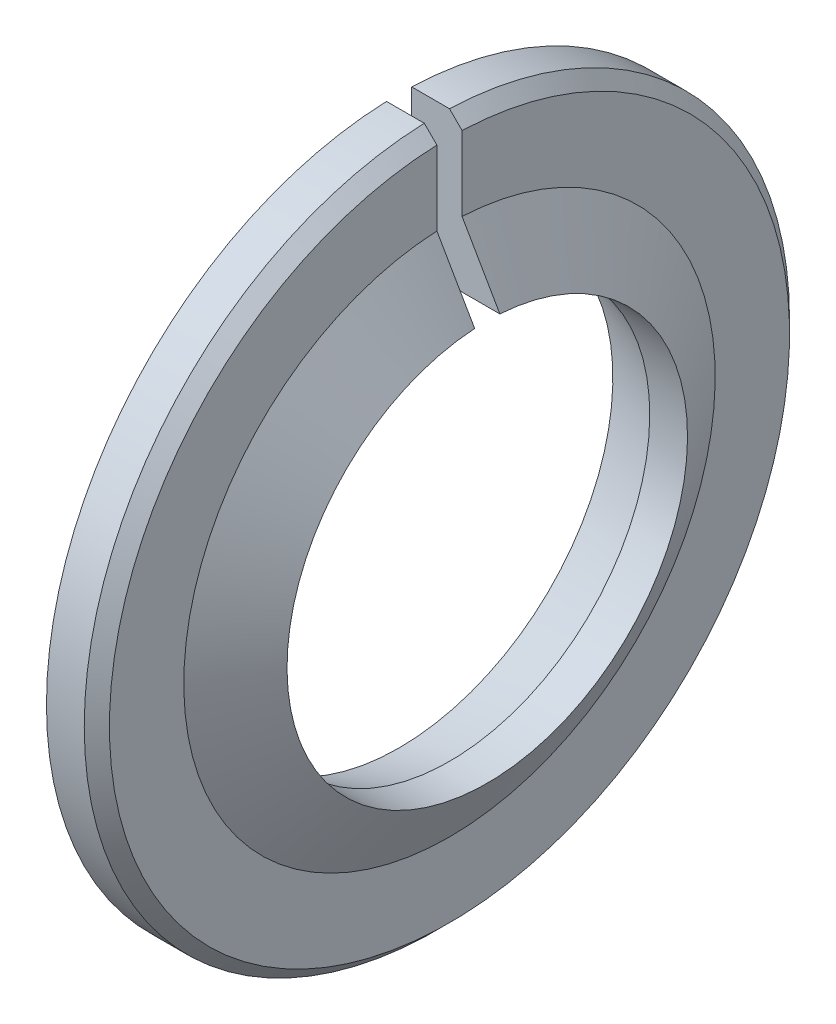
ISO-10303-21;
HEADER;
FILE_DESCRIPTION(('STEP AP214'),'2;1');
FILE_NAME('part.step','',(''),(''),'','','');
FILE_SCHEMA(('AUTOMOTIVE_DESIGN { 1 0 10303 214 1 1 1 1 }'));
ENDSEC;
DATA;
#1=APPLICATION_CONTEXT('core data for automotive mechanical design processes');
#2=APPLICATION_PROTOCOL_DEFINITION('international standard','automotive_design',2000,#1);
#3=PRODUCT_CONTEXT('',#1,'mechanical');
#4=PRODUCT('Part','Part','',(#3));
#5=PRODUCT_RELATED_PRODUCT_CATEGORY('part','',(#4));
#6=PRODUCT_DEFINITION_FORMATION('','',#4);
#7=PRODUCT_DEFINITION_CONTEXT('part definition',#1,'design');
#8=PRODUCT_DEFINITION('design','',#6,#7);
#9=PRODUCT_DEFINITION_SHAPE('','',#8);
#10=(LENGTH_UNIT() NAMED_UNIT(*) SI_UNIT(.MILLI.,.METRE.));
#11=(NAMED_UNIT(*) PLANE_ANGLE_UNIT() SI_UNIT($,.RADIAN.));
#12=(NAMED_UNIT(*) SI_UNIT($,.STERADIAN.) SOLID_ANGLE_UNIT());
#13=UNCERTAINTY_MEASURE_WITH_UNIT(LENGTH_MEASURE(1.E-05),#10,'distance_accuracy_value','');
#14=(GEOMETRIC_REPRESENTATION_CONTEXT(3) GLOBAL_UNCERTAINTY_ASSIGNED_CONTEXT((#13)) GLOBAL_UNIT_ASSIGNED_CONTEXT((#10,
#11,#12)) REPRESENTATION_CONTEXT('',''));
#15=CARTESIAN_POINT('',(0.,0.,0.));
#16=DIRECTION('',(0.,0.,1.));
#17=DIRECTION('',(1.,0.,0.));
#18=AXIS2_PLACEMENT_3D('',#15,#16,#17);
#19=CARTESIAN_POINT('',(-2.,0.,0.));
#20=DIRECTION('',(-1.,0.,0.));
#21=DIRECTION('',(0.,0.,1.));
#22=AXIS2_PLACEMENT_3D('',#19,#20,#21);
#23=CONICAL_SURFACE('',#22,8.48589838486223,0.261799387799143);
#24=CARTESIAN_POINT('',(-13.3357204832038,11.5124428321281,-0.5));
#25=CARTESIAN_POINT('',(-11.247253523238,10.9522978265261,-0.5));
#26=CARTESIAN_POINT('',(-9.15879903403004,10.3921062823094,-0.5));
#27=CARTESIAN_POINT('',(-4.98195388569182,9.27148575834977,-0.5));
#28=CARTESIAN_POINT('',(-2.89356322655805,8.71105677862014,-0.5));
#29=CARTESIAN_POINT('',(1.28311573252463,7.58981692893275,-0.5));
#30=CARTESIAN_POINT('',(3.37140403246732,7.02900605895183,-0.5));
#31=CARTESIAN_POINT('',(6.50368125119824,6.18721180055526,-0.5));
#32=CARTESIAN_POINT('',(7.54774781557188,5.90651738077954,-0.5));
#33=CARTESIAN_POINT('',(9.63579638023918,5.34481405920343,-0.5));
#34=CARTESIAN_POINT('',(10.6797783805297,5.06380515739157,-0.5));
#35=CARTESIAN_POINT('',(11.723701660467,4.78257810669005,-0.5));
#36=B_SPLINE_CURVE_WITH_KNOTS('',3,(#24,#25,#26,#27,#28,#29,#30,#31,#32,#33,#34,#35),
.UNSPECIFIED.,.F.,.F.,(4,2,2,2,2,4),(0.,6.48684131286622,12.9736822643263,19.4605236094498,
22.7039444683789,25.9473654457777),.UNSPECIFIED.);
#37=CARTESIAN_POINT('',(-2.,8.47115525759075,-0.5));
#38=VERTEX_POINT('',#37);
#39=CARTESIAN_POINT('',(0.,7.9342611502269,-0.5));
#40=VERTEX_POINT('',#39);
#41=EDGE_CURVE('E121',#38,#40,#36,.T.);
#42=ORIENTED_EDGE('',*,*,#41,.F.);
#43=CARTESIAN_POINT('',(-2.,0.,0.));
#44=DIRECTION('',(-1.,0.,0.));
#45=DIRECTION('',(0.,0.,1.));
#46=AXIS2_PLACEMENT_3D('',#43,#44,#45);
#47=CIRCLE('',#46,8.48589838486223);
#48=CARTESIAN_POINT('',(-2.,8.47115525759075,0.5));
#49=VERTEX_POINT('',#48);
#50=EDGE_CURVE('E115',#38,#49,#47,.T.);
#51=ORIENTED_EDGE('',*,*,#50,.T.);
#52=CARTESIAN_POINT('',(-13.3357204832038,11.5124428321281,0.5));
#53=CARTESIAN_POINT('',(-11.247253523238,10.9522978265261,0.5));
#54=CARTESIAN_POINT('',(-9.15879903403004,10.3921062823094,0.5));
#55=CARTESIAN_POINT('',(-4.98195388569182,9.27148575834977,0.5));
#56=CARTESIAN_POINT('',(-2.89356322655805,8.71105677862014,0.5));
#57=CARTESIAN_POINT('',(1.28311573252463,7.58981692893275,0.5));
#58=CARTESIAN_POINT('',(3.37140403246732,7.02900605895183,0.5));
#59=CARTESIAN_POINT('',(6.50368125119824,6.18721180055526,0.5));
#60=CARTESIAN_POINT('',(7.54774781557188,5.90651738077954,0.5));
#61=CARTESIAN_POINT('',(9.63579638023918,5.34481405920343,0.5));
#62=CARTESIAN_POINT('',(10.6797783805297,5.06380515739157,0.5));
#63=CARTESIAN_POINT('',(11.723701660467,4.78257810669005,0.5));
#64=B_SPLINE_CURVE_WITH_KNOTS('',3,(#52,#53,#54,#55,#56,#57,#58,#59,#60,#61,#62,#63),
.UNSPECIFIED.,.F.,.F.,(4,2,2,2,2,4),(0.,6.48684131286622,12.9736822643263,19.4605236094498,
22.7039444683789,25.9473654457777),.UNSPECIFIED.);
#65=CARTESIAN_POINT('',(0.,7.9342611502269,0.5));
#66=VERTEX_POINT('',#65);
#67=EDGE_CURVE('E98',#49,#66,#64,.T.);
#68=ORIENTED_EDGE('',*,*,#67,.T.);
#69=CARTESIAN_POINT('',(0.,0.,0.));
#70=DIRECTION('',(-1.,0.,0.));
#71=DIRECTION('',(0.,0.,1.));
#72=AXIS2_PLACEMENT_3D('',#69,#70,#71);
#73=CIRCLE('',#72,7.95);
#74=EDGE_CURVE('E138',#40,#66,#73,.T.);
#75=ORIENTED_EDGE('',*,*,#74,.F.);
#76=EDGE_LOOP('',(#42,#51,#68,#75));
#77=FACE_BOUND('',#76,.T.);
#78=ADVANCED_FACE('F36',(#77),#23,.F.);
#79=CARTESIAN_POINT('',(-6.17679811662559,0.,0.));
#80=DIRECTION('',(-1.,0.,0.));
#81=DIRECTION('',(0.,0.,1.));
#82=AXIS2_PLACEMENT_3D('',#79,#80,#81);
#83=CYLINDRICAL_SURFACE('',#82,7.95);
#84=DIRECTION('',(-1.,0.,0.));
#85=VECTOR('',#84,1.);
#86=CARTESIAN_POINT('',(-6.17679811662559,7.9342611502269,-0.5));
#87=LINE('',#86,#85);
#88=CARTESIAN_POINT('',(1.5,7.9342611502269,-0.5));
#89=VERTEX_POINT('',#88);
#90=EDGE_CURVE('E125',#40,#89,#87,.F.);
#91=ORIENTED_EDGE('',*,*,#90,.F.);
#92=ORIENTED_EDGE('',*,*,#74,.T.);
#93=DIRECTION('',(-1.,0.,0.));
#94=VECTOR('',#93,1.);
#95=CARTESIAN_POINT('',(-6.17679811662559,7.9342611502269,0.5));
#96=LINE('',#95,#94);
#97=CARTESIAN_POINT('',(1.5,7.9342611502269,0.5));
#98=VERTEX_POINT('',#97);
#99=EDGE_CURVE('E103',#66,#98,#96,.F.);
#100=ORIENTED_EDGE('',*,*,#99,.T.);
#101=CARTESIAN_POINT('',(1.5,0.,0.));
#102=DIRECTION('',(-1.,0.,0.));
#103=DIRECTION('',(0.,0.,1.));
#104=AXIS2_PLACEMENT_3D('',#101,#102,#103);
#105=CIRCLE('',#104,7.95);
#106=EDGE_CURVE('E135',#89,#98,#105,.T.);
#107=ORIENTED_EDGE('',*,*,#106,.F.);
#108=EDGE_LOOP('',(#91,#92,#100,#107));
#109=FACE_BOUND('',#108,.T.);
#110=ADVANCED_FACE('F175',(#109),#83,.F.);
#111=CARTESIAN_POINT('',(1.5,0.,0.));
#112=DIRECTION('',(-1.,0.,0.));
#113=DIRECTION('',(0.,0.,1.));
#114=AXIS2_PLACEMENT_3D('',#111,#112,#113);
#115=CONICAL_SURFACE('',#114,7.95,1.04719755119659);
#116=CARTESIAN_POINT('',(2.38782509363926,-6.39271814497121,-0.5));
#117=CARTESIAN_POINT('',(2.54334374366012,-6.12251450784551,-0.5));
#118=CARTESIAN_POINT('',(2.69882916249031,-5.85229168189097,-0.5));
#119=CARTESIAN_POINT('',(3.00966331636651,-5.31176462003764,-0.5));
#120=CARTESIAN_POINT('',(3.16501205033234,-5.04146038351776,-0.5));
#121=CARTESIAN_POINT('',(3.47567824252302,-4.50042158667612,-0.5));
#122=CARTESIAN_POINT('',(3.63099546048876,-4.22968688839139,-0.5));
#123=CARTESIAN_POINT('',(3.94127165548804,-3.68801436314191,-0.5));
#124=CARTESIAN_POINT('',(4.09623063482994,-3.41707653750101,-0.5));
#125=CARTESIAN_POINT('',(4.32758963823609,-3.01131390200916,-0.5));
#126=CARTESIAN_POINT('',(4.40425963302258,-2.87664306477934,-0.5));
#127=CARTESIAN_POINT('',(4.5573313100459,-2.60714635170991,-0.5));
#128=CARTESIAN_POINT('',(4.63373298855685,-2.47232047375162,-0.5));
#129=CARTESIAN_POINT('',(4.78605936861872,-2.20251362643857,-0.5));
#130=CARTESIAN_POINT('',(4.86198434479996,-2.06753281213724,-0.5));
#131=CARTESIAN_POINT('',(5.0131114422912,-1.79717190625146,-0.5));
#132=CARTESIAN_POINT('',(5.08831359082251,-1.66179182995591,-0.5));
#133=CARTESIAN_POINT('',(5.20029646472512,-1.45767189859273,-0.5));
#134=CARTESIAN_POINT('',(5.23761124066802,-1.38922537927284,-0.5));
#135=CARTESIAN_POINT('',(5.3116938316991,-1.25202790436129,-0.5));
#136=CARTESIAN_POINT('',(5.34846159782726,-1.18327692222492,-0.5));
#137=CARTESIAN_POINT('',(5.42119195988337,-1.04520353731802,-0.5));
#138=CARTESIAN_POINT('',(5.45715311302139,-0.975880373631923,-0.5));
#139=CARTESIAN_POINT('',(5.52762358783402,-0.836504467697241,-0.5));
#140=CARTESIAN_POINT('',(5.56213318775588,-0.766451868515186,-0.5));
#141=CARTESIAN_POINT('',(5.61241284413694,-0.659185699862089,-0.5));
#142=CARTESIAN_POINT('',(5.62918679320184,-0.622445258291185,-0.5));
#143=CARTESIAN_POINT('',(5.66165777810571,-0.548492313888752,-0.5));
#144=CARTESIAN_POINT('',(5.67735495748382,-0.511279874763738,-0.5));
#145=CARTESIAN_POINT('',(5.70714485880235,-0.436263132408765,-0.5));
#146=CARTESIAN_POINT('',(5.72123952126519,-0.398459609451356,-0.5));
#147=CARTESIAN_POINT('',(5.74703291254339,-0.322033427946696,-0.5));
#148=CARTESIAN_POINT('',(5.75873268576771,-0.283411134608745,-0.5));
#149=CARTESIAN_POINT('',(5.77555768070906,-0.217019711390778,-0.5));
#150=CARTESIAN_POINT('',(5.78160166266328,-0.189487423087857,-0.5));
#151=CARTESIAN_POINT('',(5.79145514266921,-0.134030954542856,-0.5));
#152=CARTESIAN_POINT('',(5.79526602893331,-0.106107028843645,-0.5));
#153=CARTESIAN_POINT('',(5.80024487928605,-0.0501753076858447,-0.5));
#154=CARTESIAN_POINT('',(5.80142768420916,-0.0221688821020261,-0.5));
#155=CARTESIAN_POINT('',(5.80105210346876,0.0338255573995088,-0.5));
#156=CARTESIAN_POINT('',(5.79949352439554,0.061813569878781,-0.5));
#157=CARTESIAN_POINT('',(5.79288539265126,0.126639567715719,-0.5));
#158=CARTESIAN_POINT('',(5.7868604051453,0.163376682436974,-0.5));
#159=CARTESIAN_POINT('',(5.77129595983192,0.236099059362619,-0.5));
#160=CARTESIAN_POINT('',(5.761752651668,0.272083452044069,-0.5));
#161=CARTESIAN_POINT('',(5.74006979897855,0.343743362139789,-0.5));
#162=CARTESIAN_POINT('',(5.72789860451017,0.379409039839946,-0.5));
#163=CARTESIAN_POINT('',(5.7018473108163,0.450081882560193,-0.5));
#164=CARTESIAN_POINT('',(5.68796791151003,0.485089310558083,-0.5));
#165=CARTESIAN_POINT('',(5.65723005019308,0.558959497698336,-0.5));
#166=CARTESIAN_POINT('',(5.64021609944225,0.597756898339796,-0.5));
#167=CARTESIAN_POINT('',(5.60519104679065,0.674901122437465,-0.5));
#168=CARTESIAN_POINT('',(5.58717980308285,0.713247880871385,-0.5));
#169=CARTESIAN_POINT('',(5.53211410829064,0.827834301147929,-0.5));
#170=CARTESIAN_POINT('',(5.49404375307737,0.903583411628954,-0.5));
#171=CARTESIAN_POINT('',(5.41645095804202,1.05446033192295,-0.5));
#172=CARTESIAN_POINT('',(5.37692651180106,1.12958709351484,-0.5));
#173=CARTESIAN_POINT('',(5.29705496146375,1.2793741476586,-0.5));
#174=CARTESIAN_POINT('',(5.25670809532063,1.35403456719501,-0.5));
#175=CARTESIAN_POINT('',(5.17570673191133,1.5026752987243,-0.5));
#176=CARTESIAN_POINT('',(5.13505499204102,1.57665711903832,-0.5));
#177=CARTESIAN_POINT('',(5.05339956658011,1.72443327331866,-0.5));
#178=CARTESIAN_POINT('',(5.01239585515847,1.79822759300032,-0.5));
#179=CARTESIAN_POINT('',(4.88909909859935,2.01927792570268,-0.5));
#180=CARTESIAN_POINT('',(4.80644764134551,2.1663338283873,-0.5));
#181=CARTESIAN_POINT('',(4.64085405367501,2.45976355007156,-0.5));
#182=CARTESIAN_POINT('',(4.55791328906996,2.60613814181724,-0.5));
#183=CARTESIAN_POINT('',(4.39171677411182,2.89870846783963,-0.5));
#184=CARTESIAN_POINT('',(4.30846102357132,3.04490420200987,-0.5));
#185=CARTESIAN_POINT('',(4.05839389583257,3.48332520962513,-0.5));
#186=CARTESIAN_POINT('',(3.89128476308129,3.77538054679001,-0.5));
#187=CARTESIAN_POINT('',(3.55662990890447,4.35937102946583,-0.5));
#188=CARTESIAN_POINT('',(3.38908405970527,4.65130610167335,-0.5));
#189=CARTESIAN_POINT('',(3.05377128418214,5.23504745833441,-0.5));
#190=CARTESIAN_POINT('',(2.88600435888254,5.52685374337638,-0.5));
#191=CARTESIAN_POINT('',(2.38203124510145,6.40298296413579,-0.5));
#192=CARTESIAN_POINT('',(2.04562617102011,6.98719146670213,-0.5));
#193=CARTESIAN_POINT('',(1.37261187477959,8.15541549761393,-0.5));
#194=CARTESIAN_POINT('',(1.03600267553439,8.73943103916518,-0.5));
#195=CARTESIAN_POINT('',(0.333014518975229,9.95879287481724,-0.5));
#196=CARTESIAN_POINT('',(-0.0333766116288165,10.5941321507673,-0.5));
#197=CARTESIAN_POINT('',(-0.766260383643103,11.8647803219578,-0.5));
#198=CARTESIAN_POINT('',(-1.13275302802555,12.5000892154837,-0.5));
#199=CARTESIAN_POINT('',(-1.86520570049543,13.7696536299233,-0.5));
#200=CARTESIAN_POINT('',(-2.23116563810356,14.4039092030379,-0.5));
#201=CARTESIAN_POINT('',(-2.96311230968334,15.6723767327685,-0.5));
#202=CARTESIAN_POINT('',(-3.32909904235677,16.3065886901335,-0.5));
#203=CARTESIAN_POINT('',(-3.69509667352344,16.9407943563245,-0.5));
#204=B_SPLINE_CURVE_WITH_KNOTS('',3,(#116,#117,#118,#119,#120,#121,#122,#123,#124,#125,#126,
#127,#128,#129,#130,#131,#132,#133,#134,#135,#136,#137,#138,#139,#140,#141,#142,#143,#144,#145,
#146,#147,#148,#149,#150,#151,#152,#153,#154,#155,#156,#157,#158,#159,#160,#161,#162,#163,#164,
#165,#166,#167,#168,#169,#170,#171,#172,#173,#174,#175,#176,#177,#178,#179,#180,#181,#182,#183,
#184,#185,#186,#187,#188,#189,#190,#191,#192,#193,#194,#195,#196,#197,#198,#199,#200,#201,#202,
#203),.UNSPECIFIED.,.F.,.F.,(4,2,2,2,2,2,2,2,2,2,2,2,2,2,2,2,2,2,2,2,2,2,2,2,2,2,2,2,2,2,2,2,2,
2,2,2,2,2,2,2,2,2,2,4),(0.,0.93528854780098,1.87058442159663,2.80695309819669,3.74331572425407,
4.20821416398925,4.67311903405399,5.13772555649972,5.60231451301351,5.83618463562092,
6.0700755663053,6.30435598918441,6.53859129641646,6.65974559141836,6.7808837043921,
6.90187353010763,7.02281047933006,7.10730228524976,7.19174151064234,7.27570268078445,
7.35966977478006,7.47111258398203,7.58267771702404,7.69567001539367,7.80861616951842,
7.93568713722248,8.06277622002974,8.31707447015489,8.57173784145319,8.82632854770442,
9.07957213760189,9.33283447459768,9.83890558538647,10.343625140478,10.8483449959094,
11.857797608371,12.8675892282811,13.8773761858301,15.8998031768603,17.9220343952109,
20.1222812066395,22.3226012344745,24.5193855351145,26.71609667849),.UNSPECIFIED.);
#205=CARTESIAN_POINT('',(0.,10.5362190448242,-0.5));
#206=VERTEX_POINT('',#205);
#207=EDGE_CURVE('E180',#89,#206,#204,.T.);
#208=ORIENTED_EDGE('',*,*,#207,.F.);
#209=ORIENTED_EDGE('',*,*,#106,.T.);
#210=CARTESIAN_POINT('',(2.38782509363926,-6.39271814497121,0.5));
#211=CARTESIAN_POINT('',(2.54334374366012,-6.12251450784551,0.5));
#212=CARTESIAN_POINT('',(2.69882916249031,-5.85229168189097,0.5));
#213=CARTESIAN_POINT('',(3.00966331636651,-5.31176462003764,0.5));
#214=CARTESIAN_POINT('',(3.16501205033234,-5.04146038351776,0.5));
#215=CARTESIAN_POINT('',(3.47567824252302,-4.50042158667612,0.5));
#216=CARTESIAN_POINT('',(3.63099546048876,-4.22968688839139,0.5));
#217=CARTESIAN_POINT('',(3.94127165548804,-3.68801436314191,0.5));
#218=CARTESIAN_POINT('',(4.09623063482994,-3.41707653750101,0.5));
#219=CARTESIAN_POINT('',(4.32758963823609,-3.01131390200916,0.5));
#220=CARTESIAN_POINT('',(4.40425963302258,-2.87664306477934,0.5));
#221=CARTESIAN_POINT('',(4.5573313100459,-2.60714635170991,0.5));
#222=CARTESIAN_POINT('',(4.63373298855685,-2.47232047375162,0.5));
#223=CARTESIAN_POINT('',(4.78605936861872,-2.20251362643857,0.5));
#224=CARTESIAN_POINT('',(4.86198434479996,-2.06753281213724,0.5));
#225=CARTESIAN_POINT('',(5.0131114422912,-1.79717190625146,0.5));
#226=CARTESIAN_POINT('',(5.08831359082251,-1.66179182995591,0.5));
#227=CARTESIAN_POINT('',(5.20029646472512,-1.45767189859273,0.5));
#228=CARTESIAN_POINT('',(5.23761124066802,-1.38922537927284,0.5));
#229=CARTESIAN_POINT('',(5.3116938316991,-1.25202790436129,0.5));
#230=CARTESIAN_POINT('',(5.34846159782726,-1.18327692222492,0.5));
#231=CARTESIAN_POINT('',(5.42119195988337,-1.04520353731802,0.5));
#232=CARTESIAN_POINT('',(5.45715311302139,-0.975880373631923,0.5));
#233=CARTESIAN_POINT('',(5.52762358783402,-0.836504467697241,0.5));
#234=CARTESIAN_POINT('',(5.56213318775588,-0.766451868515186,0.5));
#235=CARTESIAN_POINT('',(5.61241284413694,-0.659185699862089,0.5));
#236=CARTESIAN_POINT('',(5.62918679320184,-0.622445258291185,0.5));
#237=CARTESIAN_POINT('',(5.66165777810571,-0.548492313888752,0.5));
#238=CARTESIAN_POINT('',(5.67735495748382,-0.511279874763738,0.5));
#239=CARTESIAN_POINT('',(5.70714485880235,-0.436263132408765,0.5));
#240=CARTESIAN_POINT('',(5.72123952126519,-0.398459609451356,0.5));
#241=CARTESIAN_POINT('',(5.74703291254339,-0.322033427946696,0.5));
#242=CARTESIAN_POINT('',(5.75873268576771,-0.283411134608745,0.5));
#243=CARTESIAN_POINT('',(5.77555768070906,-0.217019711390778,0.5));
#244=CARTESIAN_POINT('',(5.78160166266328,-0.189487423087857,0.5));
#245=CARTESIAN_POINT('',(5.79145514266921,-0.134030954542856,0.5));
#246=CARTESIAN_POINT('',(5.79526602893331,-0.106107028843645,0.5));
#247=CARTESIAN_POINT('',(5.80024487928605,-0.0501753076858447,0.5));
#248=CARTESIAN_POINT('',(5.80142768420916,-0.0221688821020261,0.5));
#249=CARTESIAN_POINT('',(5.80105210346876,0.0338255573995088,0.5));
#250=CARTESIAN_POINT('',(5.79949352439554,0.061813569878781,0.5));
#251=CARTESIAN_POINT('',(5.79288539265126,0.126639567715719,0.5));
#252=CARTESIAN_POINT('',(5.7868604051453,0.163376682436974,0.5));
#253=CARTESIAN_POINT('',(5.77129595983192,0.236099059362619,0.5));
#254=CARTESIAN_POINT('',(5.761752651668,0.272083452044069,0.5));
#255=CARTESIAN_POINT('',(5.74006979897855,0.343743362139789,0.5));
#256=CARTESIAN_POINT('',(5.72789860451017,0.379409039839946,0.5));
#257=CARTESIAN_POINT('',(5.7018473108163,0.450081882560193,0.5));
#258=CARTESIAN_POINT('',(5.68796791151003,0.485089310558083,0.5));
#259=CARTESIAN_POINT('',(5.65723005019308,0.558959497698336,0.5));
#260=CARTESIAN_POINT('',(5.64021609944225,0.597756898339796,0.5));
#261=CARTESIAN_POINT('',(5.60519104679065,0.674901122437465,0.5));
#262=CARTESIAN_POINT('',(5.58717980308285,0.713247880871385,0.5));
#263=CARTESIAN_POINT('',(5.53211410829064,0.827834301147929,0.5));
#264=CARTESIAN_POINT('',(5.49404375307737,0.903583411628954,0.5));
#265=CARTESIAN_POINT('',(5.41645095804202,1.05446033192295,0.5));
#266=CARTESIAN_POINT('',(5.37692651180106,1.12958709351484,0.5));
#267=CARTESIAN_POINT('',(5.29705496146375,1.2793741476586,0.5));
#268=CARTESIAN_POINT('',(5.25670809532063,1.35403456719501,0.5));
#269=CARTESIAN_POINT('',(5.17570673191133,1.5026752987243,0.5));
#270=CARTESIAN_POINT('',(5.13505499204102,1.57665711903832,0.5));
#271=CARTESIAN_POINT('',(5.05339956658011,1.72443327331866,0.5));
#272=CARTESIAN_POINT('',(5.01239585515847,1.79822759300032,0.5));
#273=CARTESIAN_POINT('',(4.88909909859935,2.01927792570268,0.5));
#274=CARTESIAN_POINT('',(4.80644764134551,2.1663338283873,0.5));
#275=CARTESIAN_POINT('',(4.64085405367501,2.45976355007156,0.5));
#276=CARTESIAN_POINT('',(4.55791328906996,2.60613814181724,0.5));
#277=CARTESIAN_POINT('',(4.39171677411182,2.89870846783963,0.5));
#278=CARTESIAN_POINT('',(4.30846102357132,3.04490420200987,0.5));
#279=CARTESIAN_POINT('',(4.05839389583257,3.48332520962513,0.5));
#280=CARTESIAN_POINT('',(3.89128476308129,3.77538054679001,0.5));
#281=CARTESIAN_POINT('',(3.55662990890447,4.35937102946583,0.5));
#282=CARTESIAN_POINT('',(3.38908405970527,4.65130610167335,0.5));
#283=CARTESIAN_POINT('',(3.05377128418214,5.23504745833441,0.5));
#284=CARTESIAN_POINT('',(2.88600435888254,5.52685374337638,0.5));
#285=CARTESIAN_POINT('',(2.38203124510145,6.40298296413579,0.5));
#286=CARTESIAN_POINT('',(2.04562617102011,6.98719146670213,0.5));
#287=CARTESIAN_POINT('',(1.37261187477959,8.15541549761393,0.5));
#288=CARTESIAN_POINT('',(1.03600267553439,8.73943103916518,0.5));
#289=CARTESIAN_POINT('',(0.333014518975229,9.95879287481724,0.5));
#290=CARTESIAN_POINT('',(-0.0333766116288165,10.5941321507673,0.5));
#291=CARTESIAN_POINT('',(-0.766260383643103,11.8647803219578,0.5));
#292=CARTESIAN_POINT('',(-1.13275302802555,12.5000892154837,0.5));
#293=CARTESIAN_POINT('',(-1.86520570049543,13.7696536299233,0.5));
#294=CARTESIAN_POINT('',(-2.23116563810356,14.4039092030379,0.5));
#295=CARTESIAN_POINT('',(-2.96311230968334,15.6723767327685,0.5));
#296=CARTESIAN_POINT('',(-3.32909904235677,16.3065886901335,0.5));
#297=CARTESIAN_POINT('',(-3.69509667352344,16.9407943563245,0.5));
#298=B_SPLINE_CURVE_WITH_KNOTS('',3,(#210,#211,#212,#213,#214,#215,#216,#217,#218,#219,#220,
#221,#222,#223,#224,#225,#226,#227,#228,#229,#230,#231,#232,#233,#234,#235,#236,#237,#238,#239,
#240,#241,#242,#243,#244,#245,#246,#247,#248,#249,#250,#251,#252,#253,#254,#255,#256,#257,#258,
#259,#260,#261,#262,#263,#264,#265,#266,#267,#268,#269,#270,#271,#272,#273,#274,#275,#276,#277,
#278,#279,#280,#281,#282,#283,#284,#285,#286,#287,#288,#289,#290,#291,#292,#293,#294,#295,#296,
#297),.UNSPECIFIED.,.F.,.F.,(4,2,2,2,2,2,2,2,2,2,2,2,2,2,2,2,2,2,2,2,2,2,2,2,2,2,2,2,2,2,2,2,2,
2,2,2,2,2,2,2,2,2,2,4),(0.,0.93528854780098,1.87058442159663,2.80695309819669,3.74331572425407,
4.20821416398925,4.67311903405399,5.13772555649972,5.60231451301351,5.83618463562092,
6.0700755663053,6.30435598918441,6.53859129641646,6.65974559141836,6.7808837043921,
6.90187353010763,7.02281047933006,7.10730228524976,7.19174151064234,7.27570268078445,
7.35966977478006,7.47111258398203,7.58267771702404,7.69567001539367,7.80861616951842,
7.93568713722248,8.06277622002974,8.31707447015489,8.57173784145319,8.82632854770442,
9.07957213760189,9.33283447459768,9.83890558538647,10.343625140478,10.8483449959094,
11.857797608371,12.8675892282811,13.8773761858301,15.8998031768603,17.9220343952109,
20.1222812066395,22.3226012344745,24.5193855351145,26.71609667849),.UNSPECIFIED.);
#299=CARTESIAN_POINT('',(0.,10.5362190448242,0.5));
#300=VERTEX_POINT('',#299);
#301=EDGE_CURVE('E158',#98,#300,#298,.T.);
#302=ORIENTED_EDGE('',*,*,#301,.T.);
#303=CARTESIAN_POINT('',(0.,0.,0.));
#304=DIRECTION('',(-1.,0.,0.));
#305=DIRECTION('',(0.,0.,1.));
#306=AXIS2_PLACEMENT_3D('',#303,#304,#305);
#307=CIRCLE('',#306,10.5480762113533);
#308=EDGE_CURVE('E123',#206,#300,#307,.T.);
#309=ORIENTED_EDGE('',*,*,#308,.F.);
#310=EDGE_LOOP('',(#208,#209,#302,#309));
#311=FACE_BOUND('',#310,.T.);
#312=ADVANCED_FACE('F169',(#311),#115,.T.);
#313=CARTESIAN_POINT('',(0.,14.,0.));
#314=DIRECTION('',(-1.,0.,0.));
#315=DIRECTION('',(0.,0.,1.));
#316=AXIS2_PLACEMENT_3D('',#313,#314,#315);
#317=PLANE('',#316);
#318=DIRECTION('',(0.,1.,0.));
#319=VECTOR('',#318,1.);
#320=CARTESIAN_POINT('',(0.,14.,-0.5));
#321=LINE('',#320,#319);
#322=CARTESIAN_POINT('',(0.,13.490737563232,-0.5));
#323=VERTEX_POINT('',#322);
#324=EDGE_CURVE('E65',#206,#323,#321,.T.);
#325=ORIENTED_EDGE('',*,*,#324,.F.);
#326=ORIENTED_EDGE('',*,*,#308,.T.);
#327=DIRECTION('',(0.,1.,0.));
#328=VECTOR('',#327,1.);
#329=CARTESIAN_POINT('',(0.,14.,0.5));
#330=LINE('',#329,#328);
#331=CARTESIAN_POINT('',(0.,13.490737563232,0.5));
#332=VERTEX_POINT('',#331);
#333=EDGE_CURVE('E167',#300,#332,#330,.T.);
#334=ORIENTED_EDGE('',*,*,#333,.T.);
#335=CARTESIAN_POINT('',(0.,0.,0.));
#336=DIRECTION('',(-1.,0.,0.));
#337=DIRECTION('',(0.,0.,1.));
#338=AXIS2_PLACEMENT_3D('',#335,#336,#337);
#339=CIRCLE('',#338,13.5);
#340=EDGE_CURVE('E143',#332,#323,#339,.F.);
#341=ORIENTED_EDGE('',*,*,#340,.T.);
#342=EDGE_LOOP('',(#325,#326,#334,#341));
#343=FACE_BOUND('',#342,.T.);
#344=ADVANCED_FACE('F174',(#343),#317,.F.);
#345=CARTESIAN_POINT('',(-6.17679811662559,0.,0.));
#346=DIRECTION('',(-1.,0.,0.));
#347=DIRECTION('',(0.,0.,1.));
#348=AXIS2_PLACEMENT_3D('',#345,#346,#347);
#349=CYLINDRICAL_SURFACE('',#348,14.);
#350=DIRECTION('',(-1.,0.,0.));
#351=VECTOR('',#350,1.);
#352=CARTESIAN_POINT('',(-6.17679811662559,13.9910685796332,-0.5));
#353=LINE('',#352,#351);
#354=CARTESIAN_POINT('',(-0.500000000000009,13.9910685796332,-0.5));
#355=VERTEX_POINT('',#354);
#356=CARTESIAN_POINT('',(-2.,13.9910685796332,-0.5));
#357=VERTEX_POINT('',#356);
#358=EDGE_CURVE('E108',#355,#357,#353,.T.);
#359=ORIENTED_EDGE('',*,*,#358,.F.);
#360=CARTESIAN_POINT('',(-0.500000000000009,0.,0.));
#361=DIRECTION('',(-1.,0.,0.));
#362=DIRECTION('',(0.,0.,1.));
#363=AXIS2_PLACEMENT_3D('',#360,#361,#362);
#364=CIRCLE('',#363,14.);
#365=CARTESIAN_POINT('',(-0.500000000000009,13.9910685796332,0.5));
#366=VERTEX_POINT('',#365);
#367=EDGE_CURVE('E140',#355,#366,#364,.T.);
#368=ORIENTED_EDGE('',*,*,#367,.T.);
#369=DIRECTION('',(-1.,0.,0.));
#370=VECTOR('',#369,1.);
#371=CARTESIAN_POINT('',(-6.17679811662559,13.9910685796332,0.5));
#372=LINE('',#371,#370);
#373=CARTESIAN_POINT('',(-2.,13.9910685796332,0.5));
#374=VERTEX_POINT('',#373);
#375=EDGE_CURVE('E57',#366,#374,#372,.T.);
#376=ORIENTED_EDGE('',*,*,#375,.T.);
#377=CARTESIAN_POINT('',(-2.,0.,0.));
#378=DIRECTION('',(-1.,0.,0.));
#379=DIRECTION('',(0.,0.,1.));
#380=AXIS2_PLACEMENT_3D('',#377,#378,#379);
#381=CIRCLE('',#380,14.);
#382=EDGE_CURVE('E117',#357,#374,#381,.T.);
#383=ORIENTED_EDGE('',*,*,#382,.F.);
#384=EDGE_LOOP('',(#359,#368,#376,#383));
#385=FACE_BOUND('',#384,.T.);
#386=ADVANCED_FACE('F208',(#385),#349,.T.);
#387=CARTESIAN_POINT('',(-2.,14.,0.));
#388=DIRECTION('',(1.,0.,0.));
#389=DIRECTION('',(0.,0.,-1.));
#390=AXIS2_PLACEMENT_3D('',#387,#388,#389);
#391=PLANE('',#390);
#392=DIRECTION('',(0.,1.,0.));
#393=VECTOR('',#392,1.);
#394=CARTESIAN_POINT('',(-2.,0.,-0.5));
#395=LINE('',#394,#393);
#396=EDGE_CURVE('E118',#38,#357,#395,.T.);
#397=ORIENTED_EDGE('',*,*,#396,.T.);
#398=ORIENTED_EDGE('',*,*,#382,.T.);
#399=DIRECTION('',(0.,1.,0.));
#400=VECTOR('',#399,1.);
#401=CARTESIAN_POINT('',(-2.,0.,0.5));
#402=LINE('',#401,#400);
#403=EDGE_CURVE('E101',#49,#374,#402,.T.);
#404=ORIENTED_EDGE('',*,*,#403,.F.);
#405=ORIENTED_EDGE('',*,*,#50,.F.);
#406=EDGE_LOOP('',(#397,#398,#404,#405));
#407=FACE_BOUND('',#406,.T.);
#408=ADVANCED_FACE('F114',(#407),#391,.F.);
#409=CARTESIAN_POINT('',(-0.500000000000009,0.,0.));
#410=DIRECTION('',(-1.,0.,0.));
#411=DIRECTION('',(0.,0.,1.));
#412=AXIS2_PLACEMENT_3D('',#409,#410,#411);
#413=CONICAL_SURFACE('',#412,14.,0.78539816339745);
#414=ORIENTED_EDGE('',*,*,#367,.F.);
#415=CARTESIAN_POINT('',(-10.2755979888361,23.770339916096,-0.5));
#416=CARTESIAN_POINT('',(-9.37792460354182,22.8724656213733,-0.5));
#417=CARTESIAN_POINT('',(-8.48026029007237,21.9745822556273,-0.5));
#418=CARTESIAN_POINT('',(-6.68496478479847,20.1787830384338,-0.5));
#419=CARTESIAN_POINT('',(-5.78733359298259,19.2808671869977,-0.5));
#420=CARTESIAN_POINT('',(-3.99211955032411,17.4849888962837,-0.5));
#421=CARTESIAN_POINT('',(-3.09453669943563,16.5870264570517,-0.5));
#422=CARTESIAN_POINT('',(-1.29944621026801,14.7910257918512,-0.5));
#423=CARTESIAN_POINT('',(-0.401938572014484,13.892987565857,-0.5));
#424=CARTESIAN_POINT('',(0.944223224539855,12.5458288571919,-0.5));
#425=CARTESIAN_POINT('',(1.3929276584399,12.0967586137089,-0.5));
#426=CARTESIAN_POINT('',(2.29028915722917,11.1985709195923,-0.5));
#427=CARTESIAN_POINT('',(2.73894622212467,10.749453468965,-0.5));
#428=CARTESIAN_POINT('',(3.63619211878456,9.85115133912281,-0.5));
#429=CARTESIAN_POINT('',(4.08478095061905,9.40196665997799,-0.5));
#430=CARTESIAN_POINT('',(4.98185563441127,8.5034940538214,-0.5));
#431=CARTESIAN_POINT('',(5.43034148632001,8.05420612676071,-0.5));
#432=CARTESIAN_POINT('',(6.3271499056191,7.15546410855183,-0.5));
#433=CARTESIAN_POINT('',(6.77547247242213,6.70601001681743,-0.5));
#434=CARTESIAN_POINT('',(7.44773160034041,6.03160557793816,-0.5));
#435=CARTESIAN_POINT('',(7.67178034204398,5.80676706280433,-0.5));
#436=CARTESIAN_POINT('',(8.11977092918339,5.35698333325587,-0.5));
#437=CARTESIAN_POINT('',(8.34371277456665,5.13203811878888,-0.5));
#438=CARTESIAN_POINT('',(8.79144185575788,4.68199133743542,-0.5));
#439=CARTESIAN_POINT('',(9.01522909069584,4.4568897696832,-0.5));
#440=CARTESIAN_POINT('',(9.46256111562282,4.0064464382064,-0.5));
#441=CARTESIAN_POINT('',(9.68610590594215,3.78110467480988,-0.5));
#442=CARTESIAN_POINT('',(10.1327974106834,3.33002389780191,-0.5));
#443=CARTESIAN_POINT('',(10.3559441227364,3.10428488184221,-0.5));
#444=CARTESIAN_POINT('',(10.6901026308629,2.76512167032844,-0.5));
#445=CARTESIAN_POINT('',(10.8013954664476,2.65197455338685,-0.5));
#446=CARTESIAN_POINT('',(11.0236932992255,2.42539743251905,-0.5));
#447=CARTESIAN_POINT('',(11.1346982956824,2.31196742787051,-0.5));
#448=CARTESIAN_POINT('',(11.2455088495292,2.19834718539887,-0.5));
#449=B_SPLINE_CURVE_WITH_KNOTS('',3,(#415,#416,#417,#418,#419,#420,#421,#422,#423,#424,#425,
#426,#427,#428,#429,#430,#431,#432,#433,#434,#435,#436,#437,#438,#439,#440,#441,#442,#443,#444,
#445,#446,#447,#448),.UNSPECIFIED.,.F.,.F.,(4,2,2,2,2,2,2,2,2,2,2,2,2,2,2,2,4),(0.,
3.80893184662486,7.61786236406776,11.4267891989569,15.2357173252545,17.1401851678976,
19.0446527577589,20.9491183775865,22.853584901676,24.7580582097251,25.7102933282199,
26.6625289145415,27.6147698161593,28.5670094188027,29.5192546693834,29.9953795209401,
30.471505589492),.UNSPECIFIED.);
#450=EDGE_CURVE('E11',#355,#323,#449,.T.);
#451=ORIENTED_EDGE('',*,*,#450,.T.);
#452=ORIENTED_EDGE('',*,*,#340,.F.);
#453=CARTESIAN_POINT('',(-10.2755979888361,23.770339916096,0.5));
#454=CARTESIAN_POINT('',(-9.37792460354182,22.8724656213733,0.5));
#455=CARTESIAN_POINT('',(-8.48026029007237,21.9745822556273,0.5));
#456=CARTESIAN_POINT('',(-6.68496478479847,20.1787830384338,0.5));
#457=CARTESIAN_POINT('',(-5.78733359298259,19.2808671869977,0.5));
#458=CARTESIAN_POINT('',(-3.99211955032411,17.4849888962837,0.5));
#459=CARTESIAN_POINT('',(-3.09453669943563,16.5870264570517,0.5));
#460=CARTESIAN_POINT('',(-1.29944621026801,14.7910257918512,0.5));
#461=CARTESIAN_POINT('',(-0.401938572014484,13.892987565857,0.5));
#462=CARTESIAN_POINT('',(0.944223224539855,12.5458288571919,0.5));
#463=CARTESIAN_POINT('',(1.3929276584399,12.0967586137089,0.5));
#464=CARTESIAN_POINT('',(2.29028915722917,11.1985709195923,0.5));
#465=CARTESIAN_POINT('',(2.73894622212467,10.749453468965,0.5));
#466=CARTESIAN_POINT('',(3.63619211878456,9.85115133912281,0.5));
#467=CARTESIAN_POINT('',(4.08478095061905,9.40196665997799,0.5));
#468=CARTESIAN_POINT('',(4.98185563441127,8.5034940538214,0.5));
#469=CARTESIAN_POINT('',(5.43034148632001,8.05420612676071,0.5));
#470=CARTESIAN_POINT('',(6.3271499056191,7.15546410855183,0.5));
#471=CARTESIAN_POINT('',(6.77547247242213,6.70601001681743,0.5));
#472=CARTESIAN_POINT('',(7.44773160034041,6.03160557793816,0.5));
#473=CARTESIAN_POINT('',(7.67178034204398,5.80676706280433,0.5));
#474=CARTESIAN_POINT('',(8.11977092918339,5.35698333325587,0.5));
#475=CARTESIAN_POINT('',(8.34371277456665,5.13203811878888,0.5));
#476=CARTESIAN_POINT('',(8.79144185575788,4.68199133743542,0.5));
#477=CARTESIAN_POINT('',(9.01522909069584,4.4568897696832,0.5));
#478=CARTESIAN_POINT('',(9.46256111562282,4.0064464382064,0.5));
#479=CARTESIAN_POINT('',(9.68610590594215,3.78110467480988,0.5));
#480=CARTESIAN_POINT('',(10.1327974106834,3.33002389780191,0.5));
#481=CARTESIAN_POINT('',(10.3559441227364,3.10428488184221,0.5));
#482=CARTESIAN_POINT('',(10.6901026308629,2.76512167032844,0.5));
#483=CARTESIAN_POINT('',(10.8013954664476,2.65197455338685,0.5));
#484=CARTESIAN_POINT('',(11.0236932992255,2.42539743251905,0.5));
#485=CARTESIAN_POINT('',(11.1346982956824,2.31196742787051,0.5));
#486=CARTESIAN_POINT('',(11.2455088495292,2.19834718539887,0.5));
#487=B_SPLINE_CURVE_WITH_KNOTS('',3,(#453,#454,#455,#456,#457,#458,#459,#460,#461,#462,#463,
#464,#465,#466,#467,#468,#469,#470,#471,#472,#473,#474,#475,#476,#477,#478,#479,#480,#481,#482,
#483,#484,#485,#486),.UNSPECIFIED.,.F.,.F.,(4,2,2,2,2,2,2,2,2,2,2,2,2,2,2,2,4),(0.,
3.80893184662486,7.61786236406776,11.4267891989569,15.2357173252545,17.1401851678976,
19.0446527577589,20.9491183775865,22.853584901676,24.7580582097251,25.7102933282199,
26.6625289145415,27.6147698161593,28.5670094188027,29.5192546693834,29.9953795209401,
30.471505589492),.UNSPECIFIED.);
#488=EDGE_CURVE('E50',#366,#332,#487,.T.);
#489=ORIENTED_EDGE('',*,*,#488,.F.);
#490=EDGE_LOOP('',(#414,#451,#452,#489));
#491=FACE_BOUND('',#490,.T.);
#492=ADVANCED_FACE('F38',(#491),#413,.T.);
#493=CARTESIAN_POINT('',(1.5,0.,0.5));
#494=DIRECTION('',(0.,0.,1.));
#495=DIRECTION('',(1.,0.,0.));
#496=AXIS2_PLACEMENT_3D('',#493,#494,#495);
#497=PLANE('',#496);
#498=ORIENTED_EDGE('',*,*,#403,.T.);
#499=ORIENTED_EDGE('',*,*,#375,.F.);
#500=ORIENTED_EDGE('',*,*,#488,.T.);
#501=ORIENTED_EDGE('',*,*,#333,.F.);
#502=ORIENTED_EDGE('',*,*,#301,.F.);
#503=ORIENTED_EDGE('',*,*,#99,.F.);
#504=ORIENTED_EDGE('',*,*,#67,.F.);
#505=EDGE_LOOP('',(#498,#499,#500,#501,#502,#503,#504));
#506=FACE_BOUND('',#505,.T.);
#507=ADVANCED_FACE('F100',(#506),#497,.F.);
#508=CARTESIAN_POINT('',(1.5,0.,-0.5));
#509=DIRECTION('',(0.,0.,1.));
#510=DIRECTION('',(1.,0.,0.));
#511=AXIS2_PLACEMENT_3D('',#508,#509,#510);
#512=PLANE('',#511);
#513=ORIENTED_EDGE('',*,*,#41,.T.);
#514=ORIENTED_EDGE('',*,*,#90,.T.);
#515=ORIENTED_EDGE('',*,*,#207,.T.);
#516=ORIENTED_EDGE('',*,*,#324,.T.);
#517=ORIENTED_EDGE('',*,*,#450,.F.);
#518=ORIENTED_EDGE('',*,*,#358,.T.);
#519=ORIENTED_EDGE('',*,*,#396,.F.);
#520=EDGE_LOOP('',(#513,#514,#515,#516,#517,#518,#519));
#521=FACE_BOUND('',#520,.T.);
#522=ADVANCED_FACE('F152',(#521),#512,.T.);
#523=CLOSED_SHELL('',(#78,#110,#312,#344,#386,#408,#492,#507,#522));
#524=MANIFOLD_SOLID_BREP('B2',#523);
#525=ADVANCED_BREP_SHAPE_REPRESENTATION('',(#18,#524),#14);
#526=SHAPE_DEFINITION_REPRESENTATION(#9,#525);
ENDSEC;
END-ISO-10303-21;
